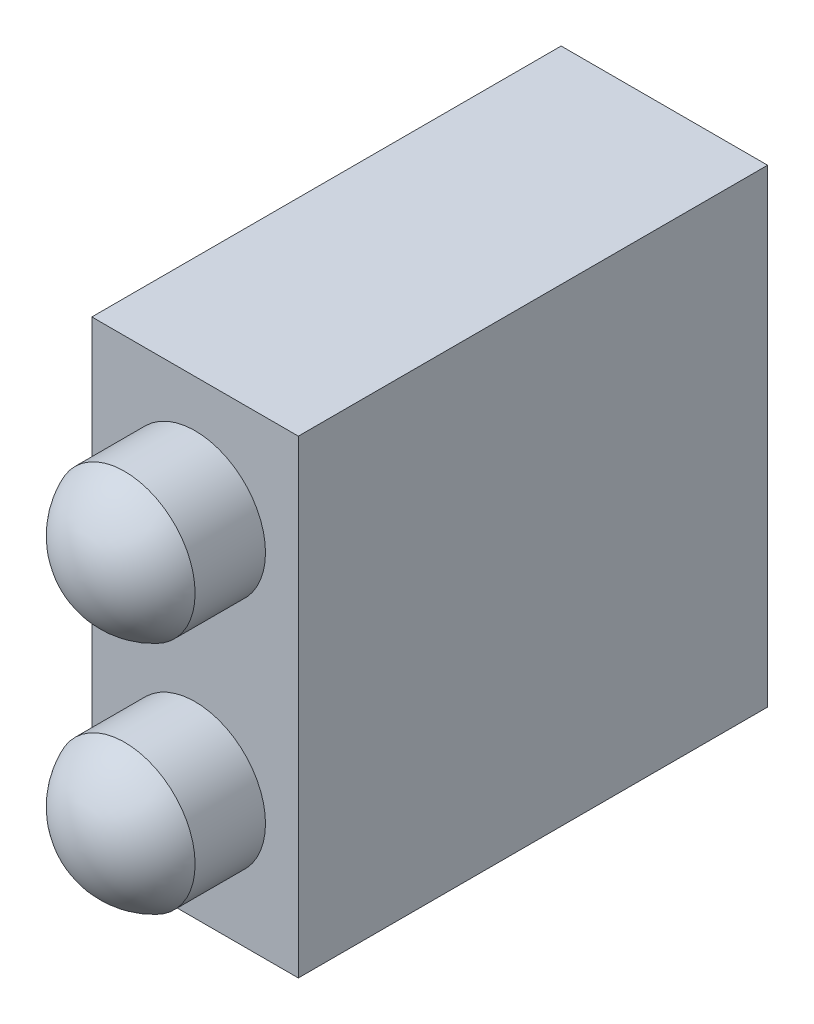
ISO-10303-21;
HEADER;
FILE_DESCRIPTION(('STEP AP214'),'2;1');
FILE_NAME('part.step','',(''),(''),'','','');
FILE_SCHEMA(('AUTOMOTIVE_DESIGN { 1 0 10303 214 1 1 1 1 }'));
ENDSEC;
DATA;
#1=APPLICATION_CONTEXT('core data for automotive mechanical design processes');
#2=APPLICATION_PROTOCOL_DEFINITION('international standard','automotive_design',2000,#1);
#3=PRODUCT_CONTEXT('',#1,'mechanical');
#4=PRODUCT('Part','Part','',(#3));
#5=PRODUCT_RELATED_PRODUCT_CATEGORY('part','',(#4));
#6=PRODUCT_DEFINITION_FORMATION('','',#4);
#7=PRODUCT_DEFINITION_CONTEXT('part definition',#1,'design');
#8=PRODUCT_DEFINITION('design','',#6,#7);
#9=PRODUCT_DEFINITION_SHAPE('','',#8);
#10=(LENGTH_UNIT() NAMED_UNIT(*) SI_UNIT(.MILLI.,.METRE.));
#11=(NAMED_UNIT(*) PLANE_ANGLE_UNIT() SI_UNIT($,.RADIAN.));
#12=(NAMED_UNIT(*) SI_UNIT($,.STERADIAN.) SOLID_ANGLE_UNIT());
#13=UNCERTAINTY_MEASURE_WITH_UNIT(LENGTH_MEASURE(1.E-05),#10,'distance_accuracy_value','');
#14=(GEOMETRIC_REPRESENTATION_CONTEXT(3) GLOBAL_UNCERTAINTY_ASSIGNED_CONTEXT((#13)) GLOBAL_UNIT_ASSIGNED_CONTEXT((#10,
#11,#12)) REPRESENTATION_CONTEXT('',''));
#15=CARTESIAN_POINT('',(0.,0.,0.));
#16=DIRECTION('',(0.,0.,1.));
#17=DIRECTION('',(1.,0.,0.));
#18=AXIS2_PLACEMENT_3D('',#15,#16,#17);
#19=CARTESIAN_POINT('',(2.2,5.,-10.));
#20=DIRECTION('',(1.,0.,0.));
#21=DIRECTION('',(0.,1.,0.));
#22=AXIS2_PLACEMENT_3D('',#19,#20,#21);
#23=PLANE('',#22);
#24=DIRECTION('',(0.,1.,0.));
#25=VECTOR('',#24,1.);
#26=CARTESIAN_POINT('',(2.2,5.,0.));
#27=LINE('',#26,#25);
#28=CARTESIAN_POINT('',(2.2,-5.,0.));
#29=VERTEX_POINT('',#28);
#30=CARTESIAN_POINT('',(2.2,5.,0.));
#31=VERTEX_POINT('',#30);
#32=EDGE_CURVE('E103',#29,#31,#27,.T.);
#33=ORIENTED_EDGE('',*,*,#32,.F.);
#34=DIRECTION('',(0.,0.,1.));
#35=VECTOR('',#34,1.);
#36=CARTESIAN_POINT('',(2.2,-5.,-10.));
#37=LINE('',#36,#35);
#38=CARTESIAN_POINT('',(2.2,-5.,-10.));
#39=VERTEX_POINT('',#38);
#40=EDGE_CURVE('E44',#39,#29,#37,.T.);
#41=ORIENTED_EDGE('',*,*,#40,.F.);
#42=DIRECTION('',(0.,1.,0.));
#43=VECTOR('',#42,1.);
#44=CARTESIAN_POINT('',(2.2,5.,-10.));
#45=LINE('',#44,#43);
#46=CARTESIAN_POINT('',(2.2,5.,-10.));
#47=VERTEX_POINT('',#46);
#48=EDGE_CURVE('E96',#39,#47,#45,.T.);
#49=ORIENTED_EDGE('',*,*,#48,.T.);
#50=DIRECTION('',(0.,0.,1.));
#51=VECTOR('',#50,1.);
#52=CARTESIAN_POINT('',(2.2,5.,-10.));
#53=LINE('',#52,#51);
#54=EDGE_CURVE('E79',#47,#31,#53,.T.);
#55=ORIENTED_EDGE('',*,*,#54,.T.);
#56=EDGE_LOOP('',(#33,#41,#49,#55));
#57=FACE_BOUND('',#56,.T.);
#58=ADVANCED_FACE('F34',(#57),#23,.T.);
#59=CARTESIAN_POINT('',(-2.2,-5.,-10.));
#60=DIRECTION('',(0.,-1.,0.));
#61=DIRECTION('',(0.,0.,-1.));
#62=AXIS2_PLACEMENT_3D('',#59,#60,#61);
#63=PLANE('',#62);
#64=DIRECTION('',(1.,0.,0.));
#65=VECTOR('',#64,1.);
#66=CARTESIAN_POINT('',(-2.2,-5.,0.));
#67=LINE('',#66,#65);
#68=CARTESIAN_POINT('',(-2.2,-5.,0.));
#69=VERTEX_POINT('',#68);
#70=EDGE_CURVE('E98',#69,#29,#67,.T.);
#71=ORIENTED_EDGE('',*,*,#70,.F.);
#72=DIRECTION('',(0.,0.,1.));
#73=VECTOR('',#72,1.);
#74=CARTESIAN_POINT('',(-2.2,-5.,-10.));
#75=LINE('',#74,#73);
#76=CARTESIAN_POINT('',(-2.2,-5.,-10.));
#77=VERTEX_POINT('',#76);
#78=EDGE_CURVE('E68',#77,#69,#75,.T.);
#79=ORIENTED_EDGE('',*,*,#78,.F.);
#80=DIRECTION('',(1.,0.,0.));
#81=VECTOR('',#80,1.);
#82=CARTESIAN_POINT('',(-2.2,-5.,-10.));
#83=LINE('',#82,#81);
#84=EDGE_CURVE('E93',#77,#39,#83,.T.);
#85=ORIENTED_EDGE('',*,*,#84,.T.);
#86=ORIENTED_EDGE('',*,*,#40,.T.);
#87=EDGE_LOOP('',(#71,#79,#85,#86));
#88=FACE_BOUND('',#87,.T.);
#89=ADVANCED_FACE('F135',(#88),#63,.T.);
#90=CARTESIAN_POINT('',(-2.2,5.,-10.));
#91=DIRECTION('',(-1.,0.,0.));
#92=DIRECTION('',(0.,-1.,0.));
#93=AXIS2_PLACEMENT_3D('',#90,#91,#92);
#94=PLANE('',#93);
#95=DIRECTION('',(0.,-1.,0.));
#96=VECTOR('',#95,1.);
#97=CARTESIAN_POINT('',(-2.2,5.,0.));
#98=LINE('',#97,#96);
#99=CARTESIAN_POINT('',(-2.2,5.,0.));
#100=VERTEX_POINT('',#99);
#101=EDGE_CURVE('E87',#100,#69,#98,.T.);
#102=ORIENTED_EDGE('',*,*,#101,.F.);
#103=DIRECTION('',(0.,0.,1.));
#104=VECTOR('',#103,1.);
#105=CARTESIAN_POINT('',(-2.2,5.,-10.));
#106=LINE('',#105,#104);
#107=CARTESIAN_POINT('',(-2.2,5.,-10.));
#108=VERTEX_POINT('',#107);
#109=EDGE_CURVE('E82',#108,#100,#106,.T.);
#110=ORIENTED_EDGE('',*,*,#109,.F.);
#111=DIRECTION('',(0.,-1.,0.));
#112=VECTOR('',#111,1.);
#113=CARTESIAN_POINT('',(-2.2,5.,-10.));
#114=LINE('',#113,#112);
#115=EDGE_CURVE('E85',#108,#77,#114,.T.);
#116=ORIENTED_EDGE('',*,*,#115,.T.);
#117=ORIENTED_EDGE('',*,*,#78,.T.);
#118=EDGE_LOOP('',(#102,#110,#116,#117));
#119=FACE_BOUND('',#118,.T.);
#120=ADVANCED_FACE('F84',(#119),#94,.T.);
#121=CARTESIAN_POINT('',(-2.2,5.,-10.));
#122=DIRECTION('',(0.,1.,0.));
#123=DIRECTION('',(0.,0.,1.));
#124=AXIS2_PLACEMENT_3D('',#121,#122,#123);
#125=PLANE('',#124);
#126=DIRECTION('',(-1.,0.,0.));
#127=VECTOR('',#126,1.);
#128=CARTESIAN_POINT('',(-2.2,5.,0.));
#129=LINE('',#128,#127);
#130=EDGE_CURVE('E106',#31,#100,#129,.T.);
#131=ORIENTED_EDGE('',*,*,#130,.F.);
#132=ORIENTED_EDGE('',*,*,#54,.F.);
#133=DIRECTION('',(-1.,0.,0.));
#134=VECTOR('',#133,1.);
#135=CARTESIAN_POINT('',(-2.2,5.,-10.));
#136=LINE('',#135,#134);
#137=EDGE_CURVE('E92',#47,#108,#136,.T.);
#138=ORIENTED_EDGE('',*,*,#137,.T.);
#139=ORIENTED_EDGE('',*,*,#109,.T.);
#140=EDGE_LOOP('',(#131,#132,#138,#139));
#141=FACE_BOUND('',#140,.T.);
#142=ADVANCED_FACE('F95',(#141),#125,.T.);
#143=CARTESIAN_POINT('',(0.,0.,-10.));
#144=DIRECTION('',(0.,0.,1.));
#145=DIRECTION('',(1.,0.,0.));
#146=AXIS2_PLACEMENT_3D('',#143,#144,#145);
#147=PLANE('',#146);
#148=ORIENTED_EDGE('',*,*,#48,.F.);
#149=ORIENTED_EDGE('',*,*,#84,.F.);
#150=ORIENTED_EDGE('',*,*,#115,.F.);
#151=ORIENTED_EDGE('',*,*,#137,.F.);
#152=EDGE_LOOP('',(#148,#149,#150,#151));
#153=FACE_BOUND('',#152,.T.);
#154=ADVANCED_FACE('F91',(#153),#147,.F.);
#155=CARTESIAN_POINT('',(0.,0.,0.));
#156=DIRECTION('',(0.,0.,1.));
#157=DIRECTION('',(1.,0.,0.));
#158=AXIS2_PLACEMENT_3D('',#155,#156,#157);
#159=PLANE('',#158);
#160=CARTESIAN_POINT('',(0.,-2.5,0.));
#161=DIRECTION('',(0.,0.,1.));
#162=DIRECTION('',(1.,0.,0.));
#163=AXIS2_PLACEMENT_3D('',#160,#161,#162);
#164=CIRCLE('',#163,1.5);
#165=CARTESIAN_POINT('',(1.5,-2.5,0.));
#166=VERTEX_POINT('',#165);
#167=EDGE_CURVE('E11',#166,#166,#164,.T.);
#168=ORIENTED_EDGE('',*,*,#167,.F.);
#169=EDGE_LOOP('',(#168));
#170=FACE_BOUND('',#169,.T.);
#171=CARTESIAN_POINT('',(0.,2.5,0.));
#172=DIRECTION('',(0.,0.,1.));
#173=DIRECTION('',(1.,0.,0.));
#174=AXIS2_PLACEMENT_3D('',#171,#172,#173);
#175=CIRCLE('',#174,1.5);
#176=CARTESIAN_POINT('',(1.5,2.5,0.));
#177=VERTEX_POINT('',#176);
#178=EDGE_CURVE('E116',#177,#177,#175,.T.);
#179=ORIENTED_EDGE('',*,*,#178,.F.);
#180=EDGE_LOOP('',(#179));
#181=FACE_BOUND('',#180,.T.);
#182=ORIENTED_EDGE('',*,*,#32,.T.);
#183=ORIENTED_EDGE('',*,*,#130,.T.);
#184=ORIENTED_EDGE('',*,*,#101,.T.);
#185=ORIENTED_EDGE('',*,*,#70,.T.);
#186=EDGE_LOOP('',(#182,#183,#184,#185));
#187=FACE_BOUND('',#186,.T.);
#188=ADVANCED_FACE('F148',(#170,#181,#187),#159,.T.);
#189=CARTESIAN_POINT('',(0.,2.5,1.5));
#190=DIRECTION('',(0.,0.,-1.));
#191=DIRECTION('',(-1.,0.,0.));
#192=AXIS2_PLACEMENT_3D('',#189,#190,#191);
#193=CYLINDRICAL_SURFACE('',#192,1.5);
#194=CARTESIAN_POINT('',(0.,2.5,1.5));
#195=DIRECTION('',(0.,0.,1.));
#196=DIRECTION('',(1.,0.,0.));
#197=AXIS2_PLACEMENT_3D('',#194,#195,#196);
#198=CIRCLE('',#197,1.5);
#199=CARTESIAN_POINT('',(1.5,2.5,1.5));
#200=VERTEX_POINT('',#199);
#201=EDGE_CURVE('E107',#200,#200,#198,.T.);
#202=ORIENTED_EDGE('',*,*,#201,.F.);
#203=EDGE_LOOP('',(#202));
#204=FACE_BOUND('',#203,.T.);
#205=ORIENTED_EDGE('',*,*,#178,.T.);
#206=EDGE_LOOP('',(#205));
#207=FACE_BOUND('',#206,.T.);
#208=ADVANCED_FACE('F144',(#204,#207),#193,.T.);
#209=CARTESIAN_POINT('',(0.,2.5,0.875));
#210=DIRECTION('',(0.,0.,1.));
#211=DIRECTION('',(1.,0.,0.));
#212=AXIS2_PLACEMENT_3D('',#209,#210,#211);
#213=SPHERICAL_SURFACE('',#212,1.625);
#214=ORIENTED_EDGE('',*,*,#201,.T.);
#215=EDGE_LOOP('',(#214));
#216=FACE_BOUND('',#215,.T.);
#217=ADVANCED_FACE('F132',(#216),#213,.T.);
#218=CARTESIAN_POINT('',(0.,-2.5,1.5));
#219=DIRECTION('',(0.,0.,-1.));
#220=DIRECTION('',(-1.,0.,0.));
#221=AXIS2_PLACEMENT_3D('',#218,#219,#220);
#222=CYLINDRICAL_SURFACE('',#221,1.5);
#223=CARTESIAN_POINT('',(0.,-2.5,1.5));
#224=DIRECTION('',(0.,0.,-1.));
#225=DIRECTION('',(1.,0.,0.));
#226=AXIS2_PLACEMENT_3D('',#223,#224,#225);
#227=CIRCLE('',#226,1.5);
#228=CARTESIAN_POINT('',(1.5,-2.5,1.5));
#229=VERTEX_POINT('',#228);
#230=EDGE_CURVE('E38',#229,#229,#227,.T.);
#231=ORIENTED_EDGE('',*,*,#230,.T.);
#232=EDGE_LOOP('',(#231));
#233=FACE_BOUND('',#232,.T.);
#234=ORIENTED_EDGE('',*,*,#167,.T.);
#235=EDGE_LOOP('',(#234));
#236=FACE_BOUND('',#235,.T.);
#237=ADVANCED_FACE('F125',(#233,#236),#222,.T.);
#238=CARTESIAN_POINT('',(0.,-2.5,0.875));
#239=DIRECTION('',(0.,0.,1.));
#240=DIRECTION('',(1.,0.,0.));
#241=AXIS2_PLACEMENT_3D('',#238,#239,#240);
#242=SPHERICAL_SURFACE('',#241,1.625);
#243=ORIENTED_EDGE('',*,*,#230,.F.);
#244=EDGE_LOOP('',(#243));
#245=FACE_BOUND('',#244,.T.);
#246=ADVANCED_FACE('F36',(#245),#242,.T.);
#247=CLOSED_SHELL('',(#58,#89,#120,#142,#154,#188,#208,#217,#237,#246));
#248=MANIFOLD_SOLID_BREP('B2',#247);
#249=ADVANCED_BREP_SHAPE_REPRESENTATION('',(#18,#248),#14);
#250=SHAPE_DEFINITION_REPRESENTATION(#9,#249);
ENDSEC;
END-ISO-10303-21;
